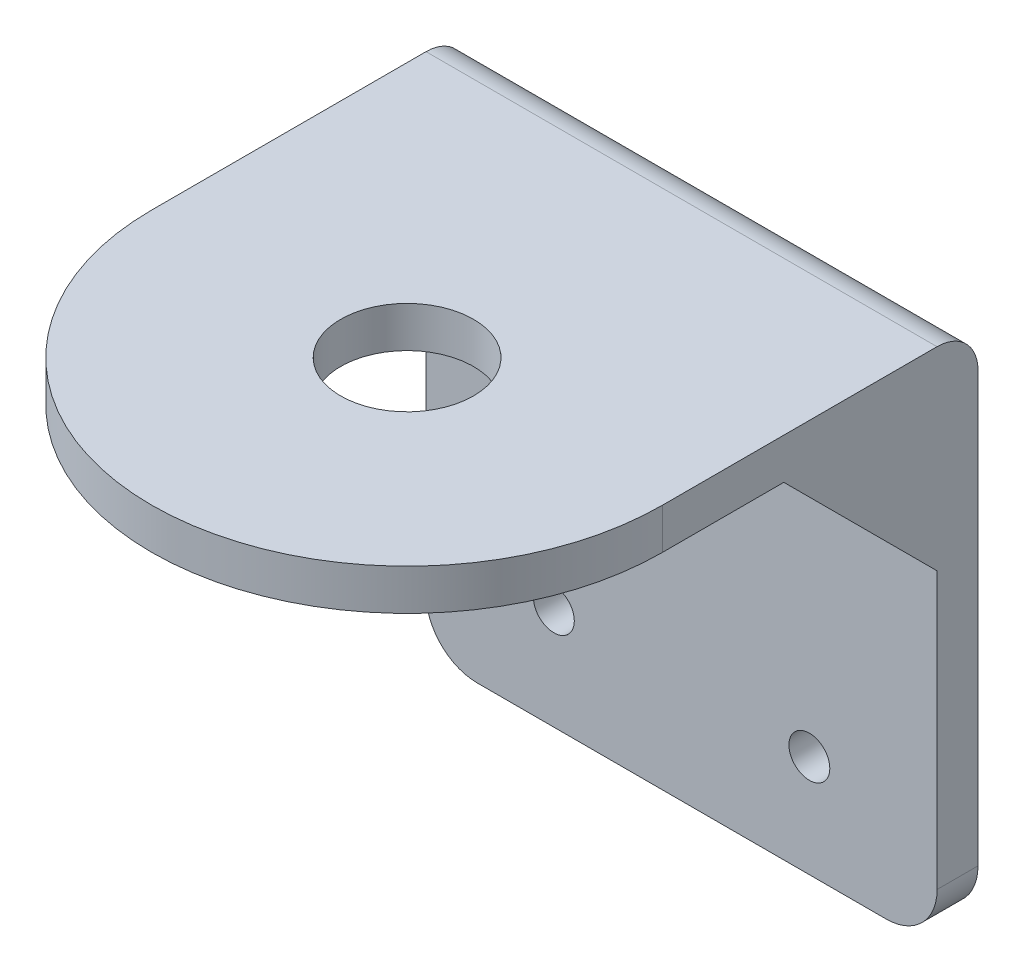
ISO-10303-21;
HEADER;
FILE_DESCRIPTION(('STEP AP214'),'2;1');
FILE_NAME('part.step','',(''),(''),'','','');
FILE_SCHEMA(('AUTOMOTIVE_DESIGN { 1 0 10303 214 1 1 1 1 }'));
ENDSEC;
DATA;
#1=APPLICATION_CONTEXT('core data for automotive mechanical design processes');
#2=APPLICATION_PROTOCOL_DEFINITION('international standard','automotive_design',2000,#1);
#3=PRODUCT_CONTEXT('',#1,'mechanical');
#4=PRODUCT('Part','Part','',(#3));
#5=PRODUCT_RELATED_PRODUCT_CATEGORY('part','',(#4));
#6=PRODUCT_DEFINITION_FORMATION('','',#4);
#7=PRODUCT_DEFINITION_CONTEXT('part definition',#1,'design');
#8=PRODUCT_DEFINITION('design','',#6,#7);
#9=PRODUCT_DEFINITION_SHAPE('','',#8);
#10=(LENGTH_UNIT() NAMED_UNIT(*) SI_UNIT(.MILLI.,.METRE.));
#11=(NAMED_UNIT(*) PLANE_ANGLE_UNIT() SI_UNIT($,.RADIAN.));
#12=(NAMED_UNIT(*) SI_UNIT($,.STERADIAN.) SOLID_ANGLE_UNIT());
#13=UNCERTAINTY_MEASURE_WITH_UNIT(LENGTH_MEASURE(1.E-05),#10,'distance_accuracy_value','');
#14=(GEOMETRIC_REPRESENTATION_CONTEXT(3) GLOBAL_UNCERTAINTY_ASSIGNED_CONTEXT((#13)) GLOBAL_UNIT_ASSIGNED_CONTEXT((#10,
#11,#12)) REPRESENTATION_CONTEXT('',''));
#15=CARTESIAN_POINT('',(0.,0.,0.));
#16=DIRECTION('',(0.,0.,1.));
#17=DIRECTION('',(1.,0.,0.));
#18=AXIS2_PLACEMENT_3D('',#15,#16,#17);
#19=CARTESIAN_POINT('',(20.,-29.9999999999998,-45.1373006168578));
#20=DIRECTION('',(0.,1.,0.));
#21=DIRECTION('',(-1.,0.,0.));
#22=AXIS2_PLACEMENT_3D('',#19,#20,#21);
#23=PLANE('',#22);
#24=CARTESIAN_POINT('',(0.,-30.0000000000001,26.8626993831422));
#25=DIRECTION('',(0.,-1.,0.));
#26=DIRECTION('',(1.,0.,0.));
#27=AXIS2_PLACEMENT_3D('',#24,#25,#26);
#28=CIRCLE('',#27,6.5);
#29=CARTESIAN_POINT('',(6.5,-30.0000000000001,26.8626993831422));
#30=VERTEX_POINT('',#29);
#31=EDGE_CURVE('E252',#30,#30,#28,.T.);
#32=ORIENTED_EDGE('',*,*,#31,.F.);
#33=EDGE_LOOP('',(#32));
#34=FACE_BOUND('',#33,.T.);
#35=DIRECTION('',(1.,0.,0.));
#36=VECTOR('',#35,1.);
#37=CARTESIAN_POINT('',(23.,-30.0000000000001,15.));
#38=LINE('',#37,#36);
#39=CARTESIAN_POINT('',(23.,-30.0000000000001,15.));
#40=VERTEX_POINT('',#39);
#41=CARTESIAN_POINT('',(25.,-30.0000000000001,15.));
#42=VERTEX_POINT('',#41);
#43=EDGE_CURVE('E592',#40,#42,#38,.T.);
#44=ORIENTED_EDGE('',*,*,#43,.T.);
#45=DIRECTION('',(0.,0.,1.));
#46=VECTOR('',#45,1.);
#47=CARTESIAN_POINT('',(25.,-29.9999999999998,-45.1373006168578));
#48=LINE('',#47,#46);
#49=CARTESIAN_POINT('',(25.,-30.0000000000001,26.8626993831422));
#50=VERTEX_POINT('',#49);
#51=EDGE_CURVE('E200',#42,#50,#48,.T.);
#52=ORIENTED_EDGE('',*,*,#51,.T.);
#53=CARTESIAN_POINT('',(0.,-30.0000000000001,26.8626993831422));
#54=DIRECTION('',(0.,-1.,0.));
#55=DIRECTION('',(1.,0.,0.));
#56=AXIS2_PLACEMENT_3D('',#53,#54,#55);
#57=CIRCLE('',#56,25.);
#58=CARTESIAN_POINT('',(-25.,-30.0000000000001,26.8626993831422));
#59=VERTEX_POINT('',#58);
#60=EDGE_CURVE('E202',#50,#59,#57,.T.);
#61=ORIENTED_EDGE('',*,*,#60,.T.);
#62=DIRECTION('',(0.,0.,-1.));
#63=VECTOR('',#62,1.);
#64=CARTESIAN_POINT('',(-25.,-29.9999999999998,-45.1373006168578));
#65=LINE('',#64,#63);
#66=CARTESIAN_POINT('',(-25.,-30.0000000000001,15.));
#67=VERTEX_POINT('',#66);
#68=EDGE_CURVE('E204',#59,#67,#65,.T.);
#69=ORIENTED_EDGE('',*,*,#68,.T.);
#70=DIRECTION('',(-1.,0.,0.));
#71=VECTOR('',#70,1.);
#72=CARTESIAN_POINT('',(-23.,-30.0000000000001,15.));
#73=LINE('',#72,#71);
#74=CARTESIAN_POINT('',(-23.,-30.0000000000001,15.));
#75=VERTEX_POINT('',#74);
#76=EDGE_CURVE('E244',#75,#67,#73,.T.);
#77=ORIENTED_EDGE('',*,*,#76,.F.);
#78=DIRECTION('',(0.,0.,-1.));
#79=VECTOR('',#78,1.);
#80=CARTESIAN_POINT('',(-23.,-30.,0.00999999999998638));
#81=LINE('',#80,#79);
#82=CARTESIAN_POINT('',(-23.,-30.,0.00999999999998638));
#83=VERTEX_POINT('',#82);
#84=EDGE_CURVE('E186',#75,#83,#81,.T.);
#85=ORIENTED_EDGE('',*,*,#84,.T.);
#86=DIRECTION('',(1.,0.,0.));
#87=VECTOR('',#86,1.);
#88=CARTESIAN_POINT('',(20.,-30.,0.00999999999997184));
#89=LINE('',#88,#87);
#90=CARTESIAN_POINT('',(23.,-30.,0.00999999999998638));
#91=VERTEX_POINT('',#90);
#92=EDGE_CURVE('E56',#83,#91,#89,.T.);
#93=ORIENTED_EDGE('',*,*,#92,.T.);
#94=DIRECTION('',(0.,0.,-1.));
#95=VECTOR('',#94,1.);
#96=CARTESIAN_POINT('',(23.,-30.,0.00999999999998638));
#97=LINE('',#96,#95);
#98=EDGE_CURVE('E160',#40,#91,#97,.T.);
#99=ORIENTED_EDGE('',*,*,#98,.F.);
#100=EDGE_LOOP('',(#44,#52,#61,#69,#77,#85,#93,#99));
#101=FACE_BOUND('',#100,.T.);
#102=ADVANCED_FACE('F46',(#34,#101),#23,.F.);
#103=CARTESIAN_POINT('',(20.,-72.,0.));
#104=DIRECTION('',(0.,0.,-1.));
#105=DIRECTION('',(-1.,0.,0.));
#106=AXIS2_PLACEMENT_3D('',#103,#104,#105);
#107=PLANE('',#106);
#108=CARTESIAN_POINT('',(-12.5,-67.,0.));
#109=DIRECTION('',(0.,0.,1.));
#110=DIRECTION('',(1.,0.,0.));
#111=AXIS2_PLACEMENT_3D('',#108,#109,#110);
#112=CIRCLE('',#111,2.);
#113=CARTESIAN_POINT('',(-10.5,-67.,0.));
#114=VERTEX_POINT('',#113);
#115=EDGE_CURVE('E296',#114,#114,#112,.T.);
#116=ORIENTED_EDGE('',*,*,#115,.F.);
#117=EDGE_LOOP('',(#116));
#118=FACE_BOUND('',#117,.T.);
#119=CARTESIAN_POINT('',(12.5,-67.,0.));
#120=DIRECTION('',(0.,0.,1.));
#121=DIRECTION('',(1.,0.,0.));
#122=AXIS2_PLACEMENT_3D('',#119,#120,#121);
#123=CIRCLE('',#122,2.);
#124=CARTESIAN_POINT('',(14.5,-67.,0.));
#125=VERTEX_POINT('',#124);
#126=EDGE_CURVE('E300',#125,#125,#123,.T.);
#127=ORIENTED_EDGE('',*,*,#126,.F.);
#128=EDGE_LOOP('',(#127));
#129=FACE_BOUND('',#128,.T.);
#130=DIRECTION('',(1.,0.,0.));
#131=VECTOR('',#130,1.);
#132=CARTESIAN_POINT('',(23.,-45.0000000000002,0.));
#133=LINE('',#132,#131);
#134=CARTESIAN_POINT('',(23.,-45.0000000000002,0.));
#135=VERTEX_POINT('',#134);
#136=CARTESIAN_POINT('',(25.,-45.0000000000002,0.));
#137=VERTEX_POINT('',#136);
#138=EDGE_CURVE('E594',#135,#137,#133,.T.);
#139=ORIENTED_EDGE('',*,*,#138,.F.);
#140=DIRECTION('',(0.,-1.,0.));
#141=VECTOR('',#140,1.);
#142=CARTESIAN_POINT('',(23.,-45.0000000000002,0.));
#143=LINE('',#142,#141);
#144=CARTESIAN_POINT('',(23.,-30.01,0.));
#145=VERTEX_POINT('',#144);
#146=EDGE_CURVE('E600',#145,#135,#143,.T.);
#147=ORIENTED_EDGE('',*,*,#146,.F.);
#148=DIRECTION('',(1.,0.,0.));
#149=VECTOR('',#148,1.);
#150=CARTESIAN_POINT('',(20.,-30.01,0.));
#151=LINE('',#150,#149);
#152=CARTESIAN_POINT('',(-23.,-30.01,0.));
#153=VERTEX_POINT('',#152);
#154=EDGE_CURVE('E179',#153,#145,#151,.T.);
#155=ORIENTED_EDGE('',*,*,#154,.F.);
#156=DIRECTION('',(0.,-1.,0.));
#157=VECTOR('',#156,1.);
#158=CARTESIAN_POINT('',(-23.,-45.0000000000002,0.));
#159=LINE('',#158,#157);
#160=CARTESIAN_POINT('',(-23.,-45.0000000000002,0.));
#161=VERTEX_POINT('',#160);
#162=EDGE_CURVE('E615',#153,#161,#159,.T.);
#163=ORIENTED_EDGE('',*,*,#162,.T.);
#164=DIRECTION('',(-1.,0.,0.));
#165=VECTOR('',#164,1.);
#166=CARTESIAN_POINT('',(-23.,-45.0000000000002,0.));
#167=LINE('',#166,#165);
#168=CARTESIAN_POINT('',(-25.,-45.0000000000002,0.));
#169=VERTEX_POINT('',#168);
#170=EDGE_CURVE('E622',#161,#169,#167,.T.);
#171=ORIENTED_EDGE('',*,*,#170,.T.);
#172=DIRECTION('',(0.,-1.,0.));
#173=VECTOR('',#172,1.);
#174=CARTESIAN_POINT('',(-25.,-72.,0.));
#175=LINE('',#174,#173);
#176=CARTESIAN_POINT('',(-25.,-72.,0.));
#177=VERTEX_POINT('',#176);
#178=EDGE_CURVE('E276',#169,#177,#175,.T.);
#179=ORIENTED_EDGE('',*,*,#178,.T.);
#180=CARTESIAN_POINT('',(-20.,-72.,0.));
#181=DIRECTION('',(0.,0.,1.));
#182=DIRECTION('',(1.,0.,0.));
#183=AXIS2_PLACEMENT_3D('',#180,#181,#182);
#184=CIRCLE('',#183,5.);
#185=CARTESIAN_POINT('',(-20.,-77.,0.));
#186=VERTEX_POINT('',#185);
#187=EDGE_CURVE('E272',#177,#186,#184,.T.);
#188=ORIENTED_EDGE('',*,*,#187,.T.);
#189=DIRECTION('',(1.,0.,0.));
#190=VECTOR('',#189,1.);
#191=CARTESIAN_POINT('',(-20.,-77.,0.));
#192=LINE('',#191,#190);
#193=CARTESIAN_POINT('',(20.,-77.,0.));
#194=VERTEX_POINT('',#193);
#195=EDGE_CURVE('E268',#186,#194,#192,.T.);
#196=ORIENTED_EDGE('',*,*,#195,.T.);
#197=CARTESIAN_POINT('',(20.,-72.,0.));
#198=DIRECTION('',(0.,0.,1.));
#199=DIRECTION('',(-1.,0.,0.));
#200=AXIS2_PLACEMENT_3D('',#197,#198,#199);
#201=CIRCLE('',#200,5.);
#202=CARTESIAN_POINT('',(25.,-72.,0.));
#203=VERTEX_POINT('',#202);
#204=EDGE_CURVE('E264',#194,#203,#201,.T.);
#205=ORIENTED_EDGE('',*,*,#204,.T.);
#206=DIRECTION('',(0.,1.,0.));
#207=VECTOR('',#206,1.);
#208=CARTESIAN_POINT('',(25.,-72.,0.));
#209=LINE('',#208,#207);
#210=EDGE_CURVE('E260',#203,#137,#209,.T.);
#211=ORIENTED_EDGE('',*,*,#210,.T.);
#212=EDGE_LOOP('',(#139,#147,#155,#163,#171,#179,#188,#196,#205,#211));
#213=FACE_BOUND('',#212,.T.);
#214=ADVANCED_FACE('F334',(#118,#129,#213),#107,.F.);
#215=CARTESIAN_POINT('',(-25.,-25.9999999999998,-45.1373006168578));
#216=DIRECTION('',(-1.,0.,0.));
#217=DIRECTION('',(0.,0.,-1.));
#218=AXIS2_PLACEMENT_3D('',#215,#216,#217);
#219=PLANE('',#218);
#220=DIRECTION('',(0.,-1.,0.));
#221=VECTOR('',#220,1.);
#222=CARTESIAN_POINT('',(-25.,-72.,-4.));
#223=LINE('',#222,#221);
#224=CARTESIAN_POINT('',(-25.,-30.01,-4.));
#225=VERTEX_POINT('',#224);
#226=CARTESIAN_POINT('',(-25.,-72.,-4.));
#227=VERTEX_POINT('',#226);
#228=EDGE_CURVE('E253',#225,#227,#223,.T.);
#229=ORIENTED_EDGE('',*,*,#228,.T.);
#230=DIRECTION('',(0.,0.,1.));
#231=VECTOR('',#230,1.);
#232=CARTESIAN_POINT('',(-25.,-72.,-4.));
#233=LINE('',#232,#231);
#234=EDGE_CURVE('E248',#227,#177,#233,.T.);
#235=ORIENTED_EDGE('',*,*,#234,.T.);
#236=ORIENTED_EDGE('',*,*,#178,.F.);
#237=DIRECTION('',(0.,0.707106781186551,0.707106781186544));
#238=VECTOR('',#237,1.);
#239=CARTESIAN_POINT('',(-25.,-30.0000000000001,15.));
#240=LINE('',#239,#238);
#241=EDGE_CURVE('E607',#169,#67,#240,.T.);
#242=ORIENTED_EDGE('',*,*,#241,.T.);
#243=ORIENTED_EDGE('',*,*,#68,.F.);
#244=DIRECTION('',(0.,-1.,0.));
#245=VECTOR('',#244,1.);
#246=CARTESIAN_POINT('',(-25.,-26.0000000000001,26.8626993831422));
#247=LINE('',#246,#245);
#248=CARTESIAN_POINT('',(-25.,-26.0000000000001,26.8626993831422));
#249=VERTEX_POINT('',#248);
#250=EDGE_CURVE('E218',#249,#59,#247,.T.);
#251=ORIENTED_EDGE('',*,*,#250,.F.);
#252=DIRECTION('',(0.,0.,-1.));
#253=VECTOR('',#252,1.);
#254=CARTESIAN_POINT('',(-25.,-25.9999999999998,-45.1373006168578));
#255=LINE('',#254,#253);
#256=CARTESIAN_POINT('',(-25.,-26.,0.0100000000000135));
#257=VERTEX_POINT('',#256);
#258=EDGE_CURVE('E195',#249,#257,#255,.T.);
#259=ORIENTED_EDGE('',*,*,#258,.T.);
#260=CARTESIAN_POINT('',(-25.,-30.01,0.00999999999999959));
#261=DIRECTION('',(1.,0.,0.));
#262=DIRECTION('',(0.,0.,1.));
#263=AXIS2_PLACEMENT_3D('',#260,#261,#262);
#264=CIRCLE('',#263,4.01);
#265=EDGE_CURVE('E233',#225,#257,#264,.T.);
#266=ORIENTED_EDGE('',*,*,#265,.F.);
#267=EDGE_LOOP('',(#229,#235,#236,#242,#243,#251,#259,#266));
#268=FACE_BOUND('',#267,.T.);
#269=ADVANCED_FACE('F48',(#268),#219,.T.);
#270=CARTESIAN_POINT('',(0.,-26.0000000000001,26.8626993831422));
#271=DIRECTION('',(0.,-1.,0.));
#272=DIRECTION('',(1.,0.,0.));
#273=AXIS2_PLACEMENT_3D('',#270,#271,#272);
#274=CYLINDRICAL_SURFACE('',#273,25.);
#275=ORIENTED_EDGE('',*,*,#60,.F.);
#276=DIRECTION('',(0.,-1.,0.));
#277=VECTOR('',#276,1.);
#278=CARTESIAN_POINT('',(25.,-26.0000000000001,26.8626993831422));
#279=LINE('',#278,#277);
#280=CARTESIAN_POINT('',(25.,-26.0000000000001,26.8626993831422));
#281=VERTEX_POINT('',#280);
#282=EDGE_CURVE('E198',#281,#50,#279,.T.);
#283=ORIENTED_EDGE('',*,*,#282,.F.);
#284=CARTESIAN_POINT('',(0.,-26.0000000000001,26.8626993831422));
#285=DIRECTION('',(0.,-1.,0.));
#286=DIRECTION('',(1.,0.,0.));
#287=AXIS2_PLACEMENT_3D('',#284,#285,#286);
#288=CIRCLE('',#287,25.);
#289=EDGE_CURVE('E199',#281,#249,#288,.T.);
#290=ORIENTED_EDGE('',*,*,#289,.T.);
#291=ORIENTED_EDGE('',*,*,#250,.T.);
#292=EDGE_LOOP('',(#275,#283,#290,#291));
#293=FACE_BOUND('',#292,.T.);
#294=ADVANCED_FACE('F344',(#293),#274,.T.);
#295=CARTESIAN_POINT('',(25.,-25.9999999999998,-45.1373006168578));
#296=DIRECTION('',(1.,0.,0.));
#297=DIRECTION('',(0.,0.,1.));
#298=AXIS2_PLACEMENT_3D('',#295,#296,#297);
#299=PLANE('',#298);
#300=DIRECTION('',(0.,0.,1.));
#301=VECTOR('',#300,1.);
#302=CARTESIAN_POINT('',(25.,-25.9999999999998,-45.1373006168578));
#303=LINE('',#302,#301);
#304=CARTESIAN_POINT('',(25.,-26.,0.0100000000000091));
#305=VERTEX_POINT('',#304);
#306=EDGE_CURVE('E50',#305,#281,#303,.T.);
#307=ORIENTED_EDGE('',*,*,#306,.T.);
#308=ORIENTED_EDGE('',*,*,#282,.T.);
#309=ORIENTED_EDGE('',*,*,#51,.F.);
#310=DIRECTION('',(0.,0.707106781186551,0.707106781186544));
#311=VECTOR('',#310,1.);
#312=CARTESIAN_POINT('',(25.,-30.0000000000001,15.));
#313=LINE('',#312,#311);
#314=EDGE_CURVE('E181',#137,#42,#313,.T.);
#315=ORIENTED_EDGE('',*,*,#314,.F.);
#316=ORIENTED_EDGE('',*,*,#210,.F.);
#317=DIRECTION('',(0.,0.,1.));
#318=VECTOR('',#317,1.);
#319=CARTESIAN_POINT('',(25.,-72.,-4.));
#320=LINE('',#319,#318);
#321=CARTESIAN_POINT('',(25.,-72.,-4.));
#322=VERTEX_POINT('',#321);
#323=EDGE_CURVE('E304',#322,#203,#320,.T.);
#324=ORIENTED_EDGE('',*,*,#323,.F.);
#325=DIRECTION('',(0.,1.,0.));
#326=VECTOR('',#325,1.);
#327=CARTESIAN_POINT('',(25.,-72.,-4.));
#328=LINE('',#327,#326);
#329=CARTESIAN_POINT('',(25.,-30.01,-4.));
#330=VERTEX_POINT('',#329);
#331=EDGE_CURVE('E281',#322,#330,#328,.T.);
#332=ORIENTED_EDGE('',*,*,#331,.T.);
#333=CARTESIAN_POINT('',(25.,-30.01,0.00999999999999959));
#334=DIRECTION('',(-1.,0.,0.));
#335=DIRECTION('',(0.,0.,-1.));
#336=AXIS2_PLACEMENT_3D('',#333,#334,#335);
#337=CIRCLE('',#336,4.01);
#338=EDGE_CURVE('E231',#305,#330,#337,.T.);
#339=ORIENTED_EDGE('',*,*,#338,.F.);
#340=EDGE_LOOP('',(#307,#308,#309,#315,#316,#324,#332,#339));
#341=FACE_BOUND('',#340,.T.);
#342=ADVANCED_FACE('F235',(#341),#299,.T.);
#343=CARTESIAN_POINT('',(20.,-25.9999999999998,-45.1373006168578));
#344=DIRECTION('',(0.,1.,0.));
#345=DIRECTION('',(-1.,0.,0.));
#346=AXIS2_PLACEMENT_3D('',#343,#344,#345);
#347=PLANE('',#346);
#348=DIRECTION('',(1.,0.,0.));
#349=VECTOR('',#348,1.);
#350=CARTESIAN_POINT('',(20.,-26.,0.0100000000000135));
#351=LINE('',#350,#349);
#352=EDGE_CURVE('E68',#257,#305,#351,.T.);
#353=ORIENTED_EDGE('',*,*,#352,.F.);
#354=ORIENTED_EDGE('',*,*,#258,.F.);
#355=ORIENTED_EDGE('',*,*,#289,.F.);
#356=ORIENTED_EDGE('',*,*,#306,.F.);
#357=EDGE_LOOP('',(#353,#354,#355,#356));
#358=FACE_BOUND('',#357,.T.);
#359=CARTESIAN_POINT('',(0.,-26.0000000000001,26.8626993831422));
#360=DIRECTION('',(0.,-1.,0.));
#361=DIRECTION('',(1.,0.,0.));
#362=AXIS2_PLACEMENT_3D('',#359,#360,#361);
#363=CIRCLE('',#362,6.5);
#364=CARTESIAN_POINT('',(6.5,-26.0000000000001,26.8626993831422));
#365=VERTEX_POINT('',#364);
#366=EDGE_CURVE('E203',#365,#365,#363,.T.);
#367=ORIENTED_EDGE('',*,*,#366,.T.);
#368=EDGE_LOOP('',(#367));
#369=FACE_BOUND('',#368,.T.);
#370=ADVANCED_FACE('F343',(#358,#369),#347,.T.);
#371=CARTESIAN_POINT('',(0.,-26.0000000000001,26.8626993831422));
#372=DIRECTION('',(0.,-1.,0.));
#373=DIRECTION('',(1.,0.,0.));
#374=AXIS2_PLACEMENT_3D('',#371,#372,#373);
#375=CYLINDRICAL_SURFACE('',#374,6.5);
#376=ORIENTED_EDGE('',*,*,#366,.F.);
#377=EDGE_LOOP('',(#376));
#378=FACE_BOUND('',#377,.T.);
#379=ORIENTED_EDGE('',*,*,#31,.T.);
#380=EDGE_LOOP('',(#379));
#381=FACE_BOUND('',#380,.T.);
#382=ADVANCED_FACE('F331',(#378,#381),#375,.F.);
#383=CARTESIAN_POINT('',(-20.,-72.,-4.));
#384=DIRECTION('',(0.,0.,1.));
#385=DIRECTION('',(1.,0.,0.));
#386=AXIS2_PLACEMENT_3D('',#383,#384,#385);
#387=CYLINDRICAL_SURFACE('',#386,5.);
#388=ORIENTED_EDGE('',*,*,#187,.F.);
#389=ORIENTED_EDGE('',*,*,#234,.F.);
#390=CARTESIAN_POINT('',(-20.,-72.,-4.));
#391=DIRECTION('',(0.,0.,1.));
#392=DIRECTION('',(1.,0.,0.));
#393=AXIS2_PLACEMENT_3D('',#390,#391,#392);
#394=CIRCLE('',#393,5.);
#395=CARTESIAN_POINT('',(-20.,-77.,-4.));
#396=VERTEX_POINT('',#395);
#397=EDGE_CURVE('E242',#227,#396,#394,.T.);
#398=ORIENTED_EDGE('',*,*,#397,.T.);
#399=DIRECTION('',(0.,0.,1.));
#400=VECTOR('',#399,1.);
#401=CARTESIAN_POINT('',(-20.,-77.,-4.));
#402=LINE('',#401,#400);
#403=EDGE_CURVE('E318',#396,#186,#402,.T.);
#404=ORIENTED_EDGE('',*,*,#403,.T.);
#405=EDGE_LOOP('',(#388,#389,#398,#404));
#406=FACE_BOUND('',#405,.T.);
#407=ADVANCED_FACE('F351',(#406),#387,.T.);
#408=CARTESIAN_POINT('',(-20.,-77.,-4.));
#409=DIRECTION('',(0.,-1.,0.));
#410=DIRECTION('',(0.,0.,-1.));
#411=AXIS2_PLACEMENT_3D('',#408,#409,#410);
#412=PLANE('',#411);
#413=ORIENTED_EDGE('',*,*,#195,.F.);
#414=ORIENTED_EDGE('',*,*,#403,.F.);
#415=DIRECTION('',(1.,0.,0.));
#416=VECTOR('',#415,1.);
#417=CARTESIAN_POINT('',(-20.,-77.,-4.));
#418=LINE('',#417,#416);
#419=CARTESIAN_POINT('',(20.,-77.,-4.));
#420=VERTEX_POINT('',#419);
#421=EDGE_CURVE('E314',#396,#420,#418,.T.);
#422=ORIENTED_EDGE('',*,*,#421,.T.);
#423=DIRECTION('',(0.,0.,1.));
#424=VECTOR('',#423,1.);
#425=CARTESIAN_POINT('',(20.,-77.,-4.));
#426=LINE('',#425,#424);
#427=EDGE_CURVE('E311',#420,#194,#426,.T.);
#428=ORIENTED_EDGE('',*,*,#427,.T.);
#429=EDGE_LOOP('',(#413,#414,#422,#428));
#430=FACE_BOUND('',#429,.T.);
#431=ADVANCED_FACE('F369',(#430),#412,.T.);
#432=CARTESIAN_POINT('',(20.,-72.,-4.));
#433=DIRECTION('',(0.,0.,1.));
#434=DIRECTION('',(1.,0.,0.));
#435=AXIS2_PLACEMENT_3D('',#432,#433,#434);
#436=CYLINDRICAL_SURFACE('',#435,5.);
#437=ORIENTED_EDGE('',*,*,#204,.F.);
#438=ORIENTED_EDGE('',*,*,#427,.F.);
#439=CARTESIAN_POINT('',(20.,-72.,-4.));
#440=DIRECTION('',(0.,0.,1.));
#441=DIRECTION('',(-1.,0.,0.));
#442=AXIS2_PLACEMENT_3D('',#439,#440,#441);
#443=CIRCLE('',#442,5.);
#444=EDGE_CURVE('E307',#420,#322,#443,.T.);
#445=ORIENTED_EDGE('',*,*,#444,.T.);
#446=ORIENTED_EDGE('',*,*,#323,.T.);
#447=EDGE_LOOP('',(#437,#438,#445,#446));
#448=FACE_BOUND('',#447,.T.);
#449=ADVANCED_FACE('F365',(#448),#436,.T.);
#450=CARTESIAN_POINT('',(12.5,-67.,-4.));
#451=DIRECTION('',(0.,0.,1.));
#452=DIRECTION('',(1.,0.,0.));
#453=AXIS2_PLACEMENT_3D('',#450,#451,#452);
#454=CYLINDRICAL_SURFACE('',#453,2.);
#455=CARTESIAN_POINT('',(12.5,-67.,-4.));
#456=DIRECTION('',(0.,0.,1.));
#457=DIRECTION('',(1.,0.,0.));
#458=AXIS2_PLACEMENT_3D('',#455,#456,#457);
#459=CIRCLE('',#458,2.);
#460=CARTESIAN_POINT('',(14.5,-67.,-4.));
#461=VERTEX_POINT('',#460);
#462=EDGE_CURVE('E288',#461,#461,#459,.T.);
#463=ORIENTED_EDGE('',*,*,#462,.F.);
#464=EDGE_LOOP('',(#463));
#465=FACE_BOUND('',#464,.T.);
#466=ORIENTED_EDGE('',*,*,#126,.T.);
#467=EDGE_LOOP('',(#466));
#468=FACE_BOUND('',#467,.T.);
#469=ADVANCED_FACE('F361',(#465,#468),#454,.F.);
#470=CARTESIAN_POINT('',(-12.5,-67.,-4.));
#471=DIRECTION('',(0.,0.,1.));
#472=DIRECTION('',(1.,0.,0.));
#473=AXIS2_PLACEMENT_3D('',#470,#471,#472);
#474=CYLINDRICAL_SURFACE('',#473,2.);
#475=CARTESIAN_POINT('',(-12.5,-67.,-4.));
#476=DIRECTION('',(0.,0.,1.));
#477=DIRECTION('',(1.,0.,0.));
#478=AXIS2_PLACEMENT_3D('',#475,#476,#477);
#479=CIRCLE('',#478,2.);
#480=CARTESIAN_POINT('',(-10.5,-67.,-4.));
#481=VERTEX_POINT('',#480);
#482=EDGE_CURVE('E292',#481,#481,#479,.T.);
#483=ORIENTED_EDGE('',*,*,#482,.F.);
#484=EDGE_LOOP('',(#483));
#485=FACE_BOUND('',#484,.T.);
#486=ORIENTED_EDGE('',*,*,#115,.T.);
#487=EDGE_LOOP('',(#486));
#488=FACE_BOUND('',#487,.T.);
#489=ADVANCED_FACE('F357',(#485,#488),#474,.F.);
#490=CARTESIAN_POINT('',(20.,-72.,-4.));
#491=DIRECTION('',(0.,0.,-1.));
#492=DIRECTION('',(-1.,0.,0.));
#493=AXIS2_PLACEMENT_3D('',#490,#491,#492);
#494=PLANE('',#493);
#495=ORIENTED_EDGE('',*,*,#482,.T.);
#496=EDGE_LOOP('',(#495));
#497=FACE_BOUND('',#496,.T.);
#498=ORIENTED_EDGE('',*,*,#462,.T.);
#499=EDGE_LOOP('',(#498));
#500=FACE_BOUND('',#499,.T.);
#501=ORIENTED_EDGE('',*,*,#228,.F.);
#502=DIRECTION('',(1.,0.,0.));
#503=VECTOR('',#502,1.);
#504=CARTESIAN_POINT('',(20.,-30.01,-4.));
#505=LINE('',#504,#503);
#506=EDGE_CURVE('E285',#225,#330,#505,.T.);
#507=ORIENTED_EDGE('',*,*,#506,.T.);
#508=ORIENTED_EDGE('',*,*,#331,.F.);
#509=ORIENTED_EDGE('',*,*,#444,.F.);
#510=ORIENTED_EDGE('',*,*,#421,.F.);
#511=ORIENTED_EDGE('',*,*,#397,.F.);
#512=EDGE_LOOP('',(#501,#507,#508,#509,#510,#511));
#513=FACE_BOUND('',#512,.T.);
#514=ADVANCED_FACE('F354',(#497,#500,#513),#494,.T.);
#515=CARTESIAN_POINT('',(-50.259014586293,-30.01,0.00999999999999959));
#516=DIRECTION('',(1.,0.,0.));
#517=DIRECTION('',(0.,0.,-1.));
#518=AXIS2_PLACEMENT_3D('',#515,#516,#517);
#519=CYLINDRICAL_SURFACE('',#518,4.01);
#520=ORIENTED_EDGE('',*,*,#338,.T.);
#521=ORIENTED_EDGE('',*,*,#506,.F.);
#522=ORIENTED_EDGE('',*,*,#265,.T.);
#523=ORIENTED_EDGE('',*,*,#352,.T.);
#524=EDGE_LOOP('',(#520,#521,#522,#523));
#525=FACE_BOUND('',#524,.T.);
#526=ADVANCED_FACE('F229',(#525),#519,.T.);
#527=CARTESIAN_POINT('',(-50.259014586293,-30.01,0.00999999999999959));
#528=DIRECTION('',(1.,0.,0.));
#529=DIRECTION('',(0.,0.,-1.));
#530=AXIS2_PLACEMENT_3D('',#527,#528,#529);
#531=CYLINDRICAL_SURFACE('',#530,0.00999999999999959);
#532=ORIENTED_EDGE('',*,*,#154,.T.);
#533=CARTESIAN_POINT('',(23.,-30.01,0.0100000000000008));
#534=DIRECTION('',(-1.,0.,0.));
#535=DIRECTION('',(0.,1.,0.));
#536=AXIS2_PLACEMENT_3D('',#533,#534,#535);
#537=CIRCLE('',#536,0.00999999999999986);
#538=EDGE_CURVE('E163',#91,#145,#537,.T.);
#539=ORIENTED_EDGE('',*,*,#538,.F.);
#540=ORIENTED_EDGE('',*,*,#92,.F.);
#541=CARTESIAN_POINT('',(-23.,-30.01,0.0100000000000008));
#542=DIRECTION('',(-1.,0.,0.));
#543=DIRECTION('',(0.,1.,0.));
#544=AXIS2_PLACEMENT_3D('',#541,#542,#543);
#545=CIRCLE('',#544,0.00999999999999986);
#546=EDGE_CURVE('E610',#83,#153,#545,.T.);
#547=ORIENTED_EDGE('',*,*,#546,.T.);
#548=EDGE_LOOP('',(#532,#539,#540,#547));
#549=FACE_BOUND('',#548,.T.);
#550=ADVANCED_FACE('F176',(#549),#531,.F.);
#551=CARTESIAN_POINT('',(-23.,-30.0000000000001,15.));
#552=DIRECTION('',(0.,-0.707106781186544,0.707106781186552));
#553=DIRECTION('',(0.,-0.707106781186551,-0.707106781186544));
#554=AXIS2_PLACEMENT_3D('',#551,#552,#553);
#555=PLANE('',#554);
#556=ORIENTED_EDGE('',*,*,#241,.F.);
#557=ORIENTED_EDGE('',*,*,#170,.F.);
#558=DIRECTION('',(0.,0.707106781186551,0.707106781186544));
#559=VECTOR('',#558,1.);
#560=CARTESIAN_POINT('',(-23.,-30.0000000000001,15.));
#561=LINE('',#560,#559);
#562=EDGE_CURVE('E628',#161,#75,#561,.T.);
#563=ORIENTED_EDGE('',*,*,#562,.T.);
#564=ORIENTED_EDGE('',*,*,#76,.T.);
#565=EDGE_LOOP('',(#556,#557,#563,#564));
#566=FACE_BOUND('',#565,.T.);
#567=ADVANCED_FACE('F379',(#566),#555,.T.);
#568=CARTESIAN_POINT('',(-23.,-30.01,0.0100000000000008));
#569=DIRECTION('',(1.,0.,0.));
#570=DIRECTION('',(0.,1.,0.));
#571=AXIS2_PLACEMENT_3D('',#568,#569,#570);
#572=PLANE('',#571);
#573=ORIENTED_EDGE('',*,*,#546,.F.);
#574=ORIENTED_EDGE('',*,*,#84,.F.);
#575=ORIENTED_EDGE('',*,*,#562,.F.);
#576=ORIENTED_EDGE('',*,*,#162,.F.);
#577=EDGE_LOOP('',(#573,#574,#575,#576));
#578=FACE_BOUND('',#577,.T.);
#579=ADVANCED_FACE('F384',(#578),#572,.T.);
#580=CARTESIAN_POINT('',(23.,-30.0000000000001,15.));
#581=DIRECTION('',(0.,0.707106781186544,-0.707106781186552));
#582=DIRECTION('',(0.,0.707106781186551,0.707106781186544));
#583=AXIS2_PLACEMENT_3D('',#580,#581,#582);
#584=PLANE('',#583);
#585=ORIENTED_EDGE('',*,*,#314,.T.);
#586=ORIENTED_EDGE('',*,*,#43,.F.);
#587=DIRECTION('',(0.,0.707106781186551,0.707106781186544));
#588=VECTOR('',#587,1.);
#589=CARTESIAN_POINT('',(23.,-30.0000000000001,15.));
#590=LINE('',#589,#588);
#591=EDGE_CURVE('E166',#135,#40,#590,.T.);
#592=ORIENTED_EDGE('',*,*,#591,.F.);
#593=ORIENTED_EDGE('',*,*,#138,.T.);
#594=EDGE_LOOP('',(#585,#586,#592,#593));
#595=FACE_BOUND('',#594,.T.);
#596=ADVANCED_FACE('F388',(#595),#584,.F.);
#597=CARTESIAN_POINT('',(23.,-30.01,0.0100000000000008));
#598=DIRECTION('',(-1.,0.,0.));
#599=DIRECTION('',(0.,1.,0.));
#600=AXIS2_PLACEMENT_3D('',#597,#598,#599);
#601=PLANE('',#600);
#602=ORIENTED_EDGE('',*,*,#538,.T.);
#603=ORIENTED_EDGE('',*,*,#146,.T.);
#604=ORIENTED_EDGE('',*,*,#591,.T.);
#605=ORIENTED_EDGE('',*,*,#98,.T.);
#606=EDGE_LOOP('',(#602,#603,#604,#605));
#607=FACE_BOUND('',#606,.T.);
#608=ADVANCED_FACE('F162',(#607),#601,.T.);
#609=CLOSED_SHELL('',(#102,#214,#269,#294,#342,#370,#382,#407,#431,#449,#469,#489,#514,#526,
#550,#567,#579,#596,#608));
#610=MANIFOLD_SOLID_BREP('B2',#609);
#611=ADVANCED_BREP_SHAPE_REPRESENTATION('',(#18,#610),#14);
#612=SHAPE_DEFINITION_REPRESENTATION(#9,#611);
ENDSEC;
END-ISO-10303-21;
